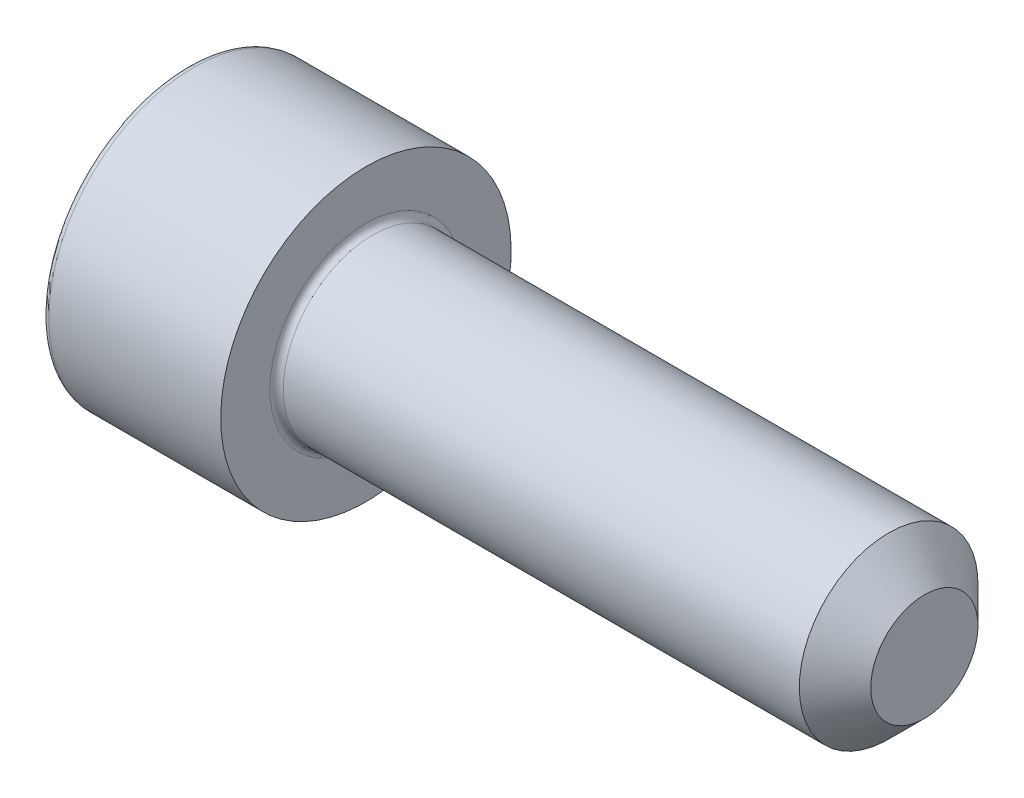
ISO-10303-21;
HEADER;
FILE_DESCRIPTION(('STEP AP214'),'2;1');
FILE_NAME('part.step','',(''),(''),'','','');
FILE_SCHEMA(('AUTOMOTIVE_DESIGN { 1 0 10303 214 1 1 1 1 }'));
ENDSEC;
DATA;
#1=APPLICATION_CONTEXT('core data for automotive mechanical design processes');
#2=APPLICATION_PROTOCOL_DEFINITION('international standard','automotive_design',2000,#1);
#3=PRODUCT_CONTEXT('',#1,'mechanical');
#4=PRODUCT('Part','Part','',(#3));
#5=PRODUCT_RELATED_PRODUCT_CATEGORY('part','',(#4));
#6=PRODUCT_DEFINITION_FORMATION('','',#4);
#7=PRODUCT_DEFINITION_CONTEXT('part definition',#1,'design');
#8=PRODUCT_DEFINITION('design','',#6,#7);
#9=PRODUCT_DEFINITION_SHAPE('','',#8);
#10=(LENGTH_UNIT() NAMED_UNIT(*) SI_UNIT(.MILLI.,.METRE.));
#11=(NAMED_UNIT(*) PLANE_ANGLE_UNIT() SI_UNIT($,.RADIAN.));
#12=(NAMED_UNIT(*) SI_UNIT($,.STERADIAN.) SOLID_ANGLE_UNIT());
#13=UNCERTAINTY_MEASURE_WITH_UNIT(LENGTH_MEASURE(1.E-05),#10,'distance_accuracy_value','');
#14=(GEOMETRIC_REPRESENTATION_CONTEXT(3) GLOBAL_UNCERTAINTY_ASSIGNED_CONTEXT((#13)) GLOBAL_UNIT_ASSIGNED_CONTEXT((#10,
#11,#12)) REPRESENTATION_CONTEXT('',''));
#15=CARTESIAN_POINT('',(0.,0.,0.));
#16=DIRECTION('',(0.,0.,1.));
#17=DIRECTION('',(1.,0.,0.));
#18=AXIS2_PLACEMENT_3D('',#15,#16,#17);
#19=CARTESIAN_POINT('',(0.,0.,0.));
#20=DIRECTION('',(-1.,0.,0.));
#21=DIRECTION('',(0.,-1.,0.));
#22=AXIS2_PLACEMENT_3D('',#19,#20,#21);
#23=PLANE('',#22);
#24=CARTESIAN_POINT('',(0.,0.,0.));
#25=DIRECTION('',(-1.,0.,0.));
#26=DIRECTION('',(0.,-1.,0.));
#27=AXIS2_PLACEMENT_3D('',#24,#25,#26);
#28=CIRCLE('',#27,6.2);
#29=CARTESIAN_POINT('',(0.,-6.2,0.));
#30=VERTEX_POINT('',#29);
#31=EDGE_CURVE('E158',#30,#30,#28,.T.);
#32=ORIENTED_EDGE('',*,*,#31,.T.);
#33=EDGE_LOOP('',(#32));
#34=FACE_BOUND('',#33,.T.);
#35=DIRECTION('',(0.,0.,-1.));
#36=VECTOR('',#35,1.);
#37=CARTESIAN_POINT('',(0.,3.,1.73205080756888));
#38=LINE('',#37,#36);
#39=CARTESIAN_POINT('',(0.,3.,1.73205080756888));
#40=VERTEX_POINT('',#39);
#41=CARTESIAN_POINT('',(0.,3.,-1.73205080756888));
#42=VERTEX_POINT('',#41);
#43=EDGE_CURVE('E54',#40,#42,#38,.T.);
#44=ORIENTED_EDGE('',*,*,#43,.F.);
#45=DIRECTION('',(0.,0.866025403784439,-0.5));
#46=VECTOR('',#45,1.);
#47=CARTESIAN_POINT('',(0.,0.,3.46410161513775));
#48=LINE('',#47,#46);
#49=CARTESIAN_POINT('',(0.,0.,3.46410161513775));
#50=VERTEX_POINT('',#49);
#51=EDGE_CURVE('E137',#50,#40,#48,.T.);
#52=ORIENTED_EDGE('',*,*,#51,.F.);
#53=DIRECTION('',(0.,0.866025403784439,0.5));
#54=VECTOR('',#53,1.);
#55=CARTESIAN_POINT('',(0.,-3.,1.73205080756888));
#56=LINE('',#55,#54);
#57=CARTESIAN_POINT('',(0.,-3.,1.73205080756888));
#58=VERTEX_POINT('',#57);
#59=EDGE_CURVE('E135',#58,#50,#56,.T.);
#60=ORIENTED_EDGE('',*,*,#59,.F.);
#61=DIRECTION('',(0.,0.,1.));
#62=VECTOR('',#61,1.);
#63=CARTESIAN_POINT('',(0.,-3.,-1.73205080756888));
#64=LINE('',#63,#62);
#65=CARTESIAN_POINT('',(0.,-3.,-1.73205080756888));
#66=VERTEX_POINT('',#65);
#67=EDGE_CURVE('E102',#66,#58,#64,.T.);
#68=ORIENTED_EDGE('',*,*,#67,.F.);
#69=DIRECTION('',(0.,-0.866025403784439,0.5));
#70=VECTOR('',#69,1.);
#71=CARTESIAN_POINT('',(0.,0.,-3.46410161513775));
#72=LINE('',#71,#70);
#73=CARTESIAN_POINT('',(0.,0.,-3.46410161513775));
#74=VERTEX_POINT('',#73);
#75=EDGE_CURVE('E131',#74,#66,#72,.T.);
#76=ORIENTED_EDGE('',*,*,#75,.F.);
#77=DIRECTION('',(0.,-0.866025403784438,-0.5));
#78=VECTOR('',#77,1.);
#79=CARTESIAN_POINT('',(0.,3.,-1.73205080756888));
#80=LINE('',#79,#78);
#81=EDGE_CURVE('E128',#42,#74,#80,.T.);
#82=ORIENTED_EDGE('',*,*,#81,.F.);
#83=EDGE_LOOP('',(#44,#52,#60,#68,#76,#82));
#84=FACE_BOUND('',#83,.T.);
#85=ADVANCED_FACE('F38',(#34,#84),#23,.T.);
#86=CARTESIAN_POINT('',(33.,0.,0.));
#87=DIRECTION('',(1.,0.,0.));
#88=DIRECTION('',(0.,1.,0.));
#89=AXIS2_PLACEMENT_3D('',#86,#87,#88);
#90=CYLINDRICAL_SURFACE('',#89,6.5);
#91=CARTESIAN_POINT('',(0.300000000000002,0.,0.));
#92=DIRECTION('',(-1.,0.,0.));
#93=DIRECTION('',(0.,-1.,0.));
#94=AXIS2_PLACEMENT_3D('',#91,#92,#93);
#95=CIRCLE('',#94,6.5);
#96=CARTESIAN_POINT('',(0.300000000000003,-6.5,0.));
#97=VERTEX_POINT('',#96);
#98=EDGE_CURVE('E155',#97,#97,#95,.F.);
#99=ORIENTED_EDGE('',*,*,#98,.T.);
#100=EDGE_LOOP('',(#99));
#101=FACE_BOUND('',#100,.T.);
#102=CARTESIAN_POINT('',(8.,0.,0.));
#103=DIRECTION('',(1.,0.,0.));
#104=DIRECTION('',(0.,1.,0.));
#105=AXIS2_PLACEMENT_3D('',#102,#103,#104);
#106=CIRCLE('',#105,6.49999999999999);
#107=CARTESIAN_POINT('',(8.,6.5,0.));
#108=VERTEX_POINT('',#107);
#109=EDGE_CURVE('E141',#108,#108,#106,.T.);
#110=ORIENTED_EDGE('',*,*,#109,.F.);
#111=EDGE_LOOP('',(#110));
#112=FACE_BOUND('',#111,.T.);
#113=ADVANCED_FACE('F175',(#101,#112),#90,.T.);
#114=CARTESIAN_POINT('',(8.,6.5,0.));
#115=DIRECTION('',(1.,0.,0.));
#116=DIRECTION('',(0.,1.,0.));
#117=AXIS2_PLACEMENT_3D('',#114,#115,#116);
#118=PLANE('',#117);
#119=CARTESIAN_POINT('',(8.,0.,0.));
#120=DIRECTION('',(1.,0.,0.));
#121=DIRECTION('',(0.,1.,0.));
#122=AXIS2_PLACEMENT_3D('',#119,#120,#121);
#123=CIRCLE('',#122,4.29999999999999);
#124=CARTESIAN_POINT('',(8.,4.3,0.));
#125=VERTEX_POINT('',#124);
#126=EDGE_CURVE('E152',#125,#125,#123,.F.);
#127=ORIENTED_EDGE('',*,*,#126,.T.);
#128=EDGE_LOOP('',(#127));
#129=FACE_BOUND('',#128,.T.);
#130=ORIENTED_EDGE('',*,*,#109,.T.);
#131=EDGE_LOOP('',(#130));
#132=FACE_BOUND('',#131,.T.);
#133=ADVANCED_FACE('F181',(#129,#132),#118,.T.);
#134=CARTESIAN_POINT('',(33.,0.,0.));
#135=DIRECTION('',(1.,0.,0.));
#136=DIRECTION('',(0.,1.,0.));
#137=AXIS2_PLACEMENT_3D('',#134,#135,#136);
#138=CYLINDRICAL_SURFACE('',#137,3.99999999999999);
#139=CARTESIAN_POINT('',(31.4,0.,0.));
#140=DIRECTION('',(1.,0.,0.));
#141=DIRECTION('',(0.,1.,0.));
#142=AXIS2_PLACEMENT_3D('',#139,#140,#141);
#143=CIRCLE('',#142,3.99999999999999);
#144=CARTESIAN_POINT('',(31.4,4.,0.));
#145=VERTEX_POINT('',#144);
#146=EDGE_CURVE('E11',#145,#145,#143,.F.);
#147=ORIENTED_EDGE('',*,*,#146,.T.);
#148=EDGE_LOOP('',(#147));
#149=FACE_BOUND('',#148,.T.);
#150=CARTESIAN_POINT('',(8.3,0.,0.));
#151=DIRECTION('',(1.,0.,0.));
#152=DIRECTION('',(0.,1.,0.));
#153=AXIS2_PLACEMENT_3D('',#150,#151,#152);
#154=CIRCLE('',#153,3.99999999999999);
#155=CARTESIAN_POINT('',(8.3,4.,0.));
#156=VERTEX_POINT('',#155);
#157=EDGE_CURVE('E149',#156,#156,#154,.T.);
#158=ORIENTED_EDGE('',*,*,#157,.T.);
#159=EDGE_LOOP('',(#158));
#160=FACE_BOUND('',#159,.T.);
#161=ADVANCED_FACE('F198',(#149,#160),#138,.T.);
#162=CARTESIAN_POINT('',(33.,4.,0.));
#163=DIRECTION('',(1.,0.,0.));
#164=DIRECTION('',(0.,1.,0.));
#165=AXIS2_PLACEMENT_3D('',#162,#163,#164);
#166=PLANE('',#165);
#167=CARTESIAN_POINT('',(33.,0.,0.));
#168=DIRECTION('',(1.,0.,0.));
#169=DIRECTION('',(0.,1.,0.));
#170=AXIS2_PLACEMENT_3D('',#167,#168,#169);
#171=CIRCLE('',#170,2.4);
#172=CARTESIAN_POINT('',(33.,2.4,0.));
#173=VERTEX_POINT('',#172);
#174=EDGE_CURVE('E47',#173,#173,#171,.T.);
#175=ORIENTED_EDGE('',*,*,#174,.T.);
#176=EDGE_LOOP('',(#175));
#177=FACE_BOUND('',#176,.T.);
#178=ADVANCED_FACE('F163',(#177),#166,.T.);
#179=CARTESIAN_POINT('',(2.5,3.,1.73205080756888));
#180=DIRECTION('',(0.,1.,0.));
#181=DIRECTION('',(-1.,0.,0.));
#182=AXIS2_PLACEMENT_3D('',#179,#180,#181);
#183=PLANE('',#182);
#184=ORIENTED_EDGE('',*,*,#43,.T.);
#185=DIRECTION('',(-1.,0.,0.));
#186=VECTOR('',#185,1.);
#187=CARTESIAN_POINT('',(2.5,3.,-1.73205080756888));
#188=LINE('',#187,#186);
#189=CARTESIAN_POINT('',(2.5,3.,-1.73205080756888));
#190=VERTEX_POINT('',#189);
#191=EDGE_CURVE('E84',#190,#42,#188,.T.);
#192=ORIENTED_EDGE('',*,*,#191,.F.);
#193=DIRECTION('',(0.,0.,-1.));
#194=VECTOR('',#193,1.);
#195=CARTESIAN_POINT('',(2.5,3.,1.73205080756888));
#196=LINE('',#195,#194);
#197=CARTESIAN_POINT('',(2.5,3.,1.73205080756888));
#198=VERTEX_POINT('',#197);
#199=EDGE_CURVE('E139',#198,#190,#196,.T.);
#200=ORIENTED_EDGE('',*,*,#199,.F.);
#201=DIRECTION('',(-1.,0.,0.));
#202=VECTOR('',#201,1.);
#203=CARTESIAN_POINT('',(2.5,3.,1.73205080756888));
#204=LINE('',#203,#202);
#205=EDGE_CURVE('E62',#198,#40,#204,.T.);
#206=ORIENTED_EDGE('',*,*,#205,.T.);
#207=EDGE_LOOP('',(#184,#192,#200,#206));
#208=FACE_BOUND('',#207,.T.);
#209=ADVANCED_FACE('F206',(#208),#183,.F.);
#210=CARTESIAN_POINT('',(2.5,0.,3.46410161513775));
#211=DIRECTION('',(0.,0.5,0.866025403784439));
#212=DIRECTION('',(0.,-0.866025403784439,0.5));
#213=AXIS2_PLACEMENT_3D('',#210,#211,#212);
#214=PLANE('',#213);
#215=ORIENTED_EDGE('',*,*,#51,.T.);
#216=ORIENTED_EDGE('',*,*,#205,.F.);
#217=DIRECTION('',(0.,0.866025403784439,-0.5));
#218=VECTOR('',#217,1.);
#219=CARTESIAN_POINT('',(2.5,0.,3.46410161513775));
#220=LINE('',#219,#218);
#221=CARTESIAN_POINT('',(2.5,0.,3.46410161513775));
#222=VERTEX_POINT('',#221);
#223=EDGE_CURVE('E114',#222,#198,#220,.T.);
#224=ORIENTED_EDGE('',*,*,#223,.F.);
#225=DIRECTION('',(-1.,0.,0.));
#226=VECTOR('',#225,1.);
#227=CARTESIAN_POINT('',(2.5,0.,3.46410161513775));
#228=LINE('',#227,#226);
#229=EDGE_CURVE('E106',#222,#50,#228,.T.);
#230=ORIENTED_EDGE('',*,*,#229,.T.);
#231=EDGE_LOOP('',(#215,#216,#224,#230));
#232=FACE_BOUND('',#231,.T.);
#233=ADVANCED_FACE('F212',(#232),#214,.F.);
#234=CARTESIAN_POINT('',(2.5,-3.,1.73205080756888));
#235=DIRECTION('',(0.,-0.5,0.866025403784439));
#236=DIRECTION('',(0.,-0.866025403784439,-0.5));
#237=AXIS2_PLACEMENT_3D('',#234,#235,#236);
#238=PLANE('',#237);
#239=ORIENTED_EDGE('',*,*,#59,.T.);
#240=ORIENTED_EDGE('',*,*,#229,.F.);
#241=DIRECTION('',(0.,0.866025403784439,0.5));
#242=VECTOR('',#241,1.);
#243=CARTESIAN_POINT('',(2.5,-3.,1.73205080756888));
#244=LINE('',#243,#242);
#245=CARTESIAN_POINT('',(2.5,-3.,1.73205080756888));
#246=VERTEX_POINT('',#245);
#247=EDGE_CURVE('E110',#246,#222,#244,.T.);
#248=ORIENTED_EDGE('',*,*,#247,.F.);
#249=DIRECTION('',(-1.,0.,0.));
#250=VECTOR('',#249,1.);
#251=CARTESIAN_POINT('',(2.5,-3.,1.73205080756888));
#252=LINE('',#251,#250);
#253=EDGE_CURVE('E95',#246,#58,#252,.T.);
#254=ORIENTED_EDGE('',*,*,#253,.T.);
#255=EDGE_LOOP('',(#239,#240,#248,#254));
#256=FACE_BOUND('',#255,.T.);
#257=ADVANCED_FACE('F111',(#256),#238,.F.);
#258=CARTESIAN_POINT('',(2.5,-3.,-1.73205080756888));
#259=DIRECTION('',(0.,-1.,0.));
#260=DIRECTION('',(0.,0.,-1.));
#261=AXIS2_PLACEMENT_3D('',#258,#259,#260);
#262=PLANE('',#261);
#263=ORIENTED_EDGE('',*,*,#67,.T.);
#264=ORIENTED_EDGE('',*,*,#253,.F.);
#265=DIRECTION('',(0.,0.,1.));
#266=VECTOR('',#265,1.);
#267=CARTESIAN_POINT('',(2.5,-3.,-1.73205080756888));
#268=LINE('',#267,#266);
#269=CARTESIAN_POINT('',(2.5,-3.,-1.73205080756888));
#270=VERTEX_POINT('',#269);
#271=EDGE_CURVE('E99',#270,#246,#268,.T.);
#272=ORIENTED_EDGE('',*,*,#271,.F.);
#273=DIRECTION('',(-1.,0.,0.));
#274=VECTOR('',#273,1.);
#275=CARTESIAN_POINT('',(2.5,-3.,-1.73205080756888));
#276=LINE('',#275,#274);
#277=EDGE_CURVE('E107',#270,#66,#276,.T.);
#278=ORIENTED_EDGE('',*,*,#277,.T.);
#279=EDGE_LOOP('',(#263,#264,#272,#278));
#280=FACE_BOUND('',#279,.T.);
#281=ADVANCED_FACE('F97',(#280),#262,.F.);
#282=CARTESIAN_POINT('',(2.5,0.,-3.46410161513775));
#283=DIRECTION('',(0.,-0.5,-0.866025403784439));
#284=DIRECTION('',(0.,0.866025403784439,-0.5));
#285=AXIS2_PLACEMENT_3D('',#282,#283,#284);
#286=PLANE('',#285);
#287=ORIENTED_EDGE('',*,*,#75,.T.);
#288=ORIENTED_EDGE('',*,*,#277,.F.);
#289=DIRECTION('',(0.,-0.866025403784439,0.5));
#290=VECTOR('',#289,1.);
#291=CARTESIAN_POINT('',(2.5,0.,-3.46410161513775));
#292=LINE('',#291,#290);
#293=CARTESIAN_POINT('',(2.5,0.,-3.46410161513775));
#294=VERTEX_POINT('',#293);
#295=EDGE_CURVE('E120',#294,#270,#292,.T.);
#296=ORIENTED_EDGE('',*,*,#295,.F.);
#297=DIRECTION('',(-1.,0.,0.));
#298=VECTOR('',#297,1.);
#299=CARTESIAN_POINT('',(2.5,0.,-3.46410161513775));
#300=LINE('',#299,#298);
#301=EDGE_CURVE('E144',#294,#74,#300,.T.);
#302=ORIENTED_EDGE('',*,*,#301,.T.);
#303=EDGE_LOOP('',(#287,#288,#296,#302));
#304=FACE_BOUND('',#303,.T.);
#305=ADVANCED_FACE('F215',(#304),#286,.F.);
#306=CARTESIAN_POINT('',(2.5,3.,-1.73205080756888));
#307=DIRECTION('',(0.,0.5,-0.866025403784439));
#308=DIRECTION('',(0.,0.866025403784439,0.5));
#309=AXIS2_PLACEMENT_3D('',#306,#307,#308);
#310=PLANE('',#309);
#311=ORIENTED_EDGE('',*,*,#81,.T.);
#312=ORIENTED_EDGE('',*,*,#301,.F.);
#313=DIRECTION('',(0.,-0.866025403784438,-0.5));
#314=VECTOR('',#313,1.);
#315=CARTESIAN_POINT('',(2.5,3.,-1.73205080756888));
#316=LINE('',#315,#314);
#317=EDGE_CURVE('E122',#190,#294,#316,.T.);
#318=ORIENTED_EDGE('',*,*,#317,.F.);
#319=ORIENTED_EDGE('',*,*,#191,.T.);
#320=EDGE_LOOP('',(#311,#312,#318,#319));
#321=FACE_BOUND('',#320,.T.);
#322=ADVANCED_FACE('F192',(#321),#310,.F.);
#323=CARTESIAN_POINT('',(2.5,0.,0.));
#324=DIRECTION('',(-1.,0.,0.));
#325=DIRECTION('',(0.,-1.,0.));
#326=AXIS2_PLACEMENT_3D('',#323,#324,#325);
#327=PLANE('',#326);
#328=ORIENTED_EDGE('',*,*,#199,.T.);
#329=ORIENTED_EDGE('',*,*,#317,.T.);
#330=ORIENTED_EDGE('',*,*,#295,.T.);
#331=ORIENTED_EDGE('',*,*,#271,.T.);
#332=ORIENTED_EDGE('',*,*,#247,.T.);
#333=ORIENTED_EDGE('',*,*,#223,.T.);
#334=EDGE_LOOP('',(#328,#329,#330,#331,#332,#333));
#335=FACE_BOUND('',#334,.T.);
#336=ADVANCED_FACE('F117',(#335),#327,.T.);
#337=CARTESIAN_POINT('',(8.3,0.,0.));
#338=DIRECTION('',(1.,0.,0.));
#339=DIRECTION('',(0.,1.,0.));
#340=AXIS2_PLACEMENT_3D('',#337,#338,#339);
#341=TOROIDAL_SURFACE('',#340,4.29999999999999,0.3);
#342=ORIENTED_EDGE('',*,*,#126,.F.);
#343=EDGE_LOOP('',(#342));
#344=FACE_BOUND('',#343,.T.);
#345=ORIENTED_EDGE('',*,*,#157,.F.);
#346=EDGE_LOOP('',(#345));
#347=FACE_BOUND('',#346,.T.);
#348=ADVANCED_FACE('F171',(#344,#347),#341,.F.);
#349=CARTESIAN_POINT('',(0.300000000000002,0.,0.));
#350=DIRECTION('',(-1.,0.,0.));
#351=DIRECTION('',(0.,-1.,0.));
#352=AXIS2_PLACEMENT_3D('',#349,#350,#351);
#353=TOROIDAL_SURFACE('',#352,6.2,0.3);
#354=ORIENTED_EDGE('',*,*,#31,.F.);
#355=EDGE_LOOP('',(#354));
#356=FACE_BOUND('',#355,.T.);
#357=ORIENTED_EDGE('',*,*,#98,.F.);
#358=EDGE_LOOP('',(#357));
#359=FACE_BOUND('',#358,.T.);
#360=ADVANCED_FACE('F166',(#356,#359),#353,.T.);
#361=CARTESIAN_POINT('',(33.,0.,0.));
#362=DIRECTION('',(-1.,0.,0.));
#363=DIRECTION('',(0.,-1.,0.));
#364=AXIS2_PLACEMENT_3D('',#361,#362,#363);
#365=CONICAL_SURFACE('',#364,2.4,0.785398163397446);
#366=ORIENTED_EDGE('',*,*,#146,.F.);
#367=EDGE_LOOP('',(#366));
#368=FACE_BOUND('',#367,.T.);
#369=ORIENTED_EDGE('',*,*,#174,.F.);
#370=EDGE_LOOP('',(#369));
#371=FACE_BOUND('',#370,.T.);
#372=ADVANCED_FACE('F41',(#368,#371),#365,.T.);
#373=CLOSED_SHELL('',(#85,#113,#133,#161,#178,#209,#233,#257,#281,#305,#322,#336,#348,#360,#372));
#374=MANIFOLD_SOLID_BREP('B2',#373);
#375=ADVANCED_BREP_SHAPE_REPRESENTATION('',(#18,#374),#14);
#376=SHAPE_DEFINITION_REPRESENTATION(#9,#375);
ENDSEC;
END-ISO-10303-21;
